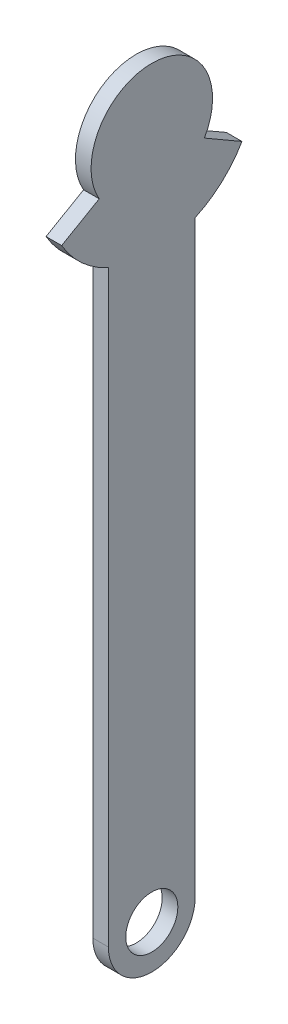
ISO-10303-21;
HEADER;
FILE_DESCRIPTION(('STEP AP214'),'2;1');
FILE_NAME('part.step','',(''),(''),'','','');
FILE_SCHEMA(('AUTOMOTIVE_DESIGN { 1 0 10303 214 1 1 1 1 }'));
ENDSEC;
DATA;
#1=APPLICATION_CONTEXT('core data for automotive mechanical design processes');
#2=APPLICATION_PROTOCOL_DEFINITION('international standard','automotive_design',2000,#1);
#3=PRODUCT_CONTEXT('',#1,'mechanical');
#4=PRODUCT('Part','Part','',(#3));
#5=PRODUCT_RELATED_PRODUCT_CATEGORY('part','',(#4));
#6=PRODUCT_DEFINITION_FORMATION('','',#4);
#7=PRODUCT_DEFINITION_CONTEXT('part definition',#1,'design');
#8=PRODUCT_DEFINITION('design','',#6,#7);
#9=PRODUCT_DEFINITION_SHAPE('','',#8);
#10=(LENGTH_UNIT() NAMED_UNIT(*) SI_UNIT(.MILLI.,.METRE.));
#11=(NAMED_UNIT(*) PLANE_ANGLE_UNIT() SI_UNIT($,.RADIAN.));
#12=(NAMED_UNIT(*) SI_UNIT($,.STERADIAN.) SOLID_ANGLE_UNIT());
#13=UNCERTAINTY_MEASURE_WITH_UNIT(LENGTH_MEASURE(1.E-05),#10,'distance_accuracy_value','');
#14=(GEOMETRIC_REPRESENTATION_CONTEXT(3) GLOBAL_UNCERTAINTY_ASSIGNED_CONTEXT((#13)) GLOBAL_UNIT_ASSIGNED_CONTEXT((#10,
#11,#12)) REPRESENTATION_CONTEXT('',''));
#15=CARTESIAN_POINT('',(0.,0.,0.));
#16=DIRECTION('',(0.,0.,1.));
#17=DIRECTION('',(1.,0.,0.));
#18=AXIS2_PLACEMENT_3D('',#15,#16,#17);
#19=CARTESIAN_POINT('',(9.,196.8,0.));
#20=DIRECTION('',(1.,0.,0.));
#21=DIRECTION('',(0.,0.,-1.));
#22=AXIS2_PLACEMENT_3D('',#19,#20,#21);
#23=PLANE('',#22);
#24=CARTESIAN_POINT('',(9.,196.8,0.));
#25=DIRECTION('',(1.,0.,0.));
#26=DIRECTION('',(0.,0.,-1.));
#27=AXIS2_PLACEMENT_3D('',#24,#25,#26);
#28=CIRCLE('',#27,60.);
#29=CARTESIAN_POINT('',(9.,142.256439426821,-25.));
#30=VERTEX_POINT('',#29);
#31=CARTESIAN_POINT('',(9.,166.8,-51.9615242270663));
#32=VERTEX_POINT('',#31);
#33=EDGE_CURVE('E170',#30,#32,#28,.T.);
#34=ORIENTED_EDGE('',*,*,#33,.T.);
#35=DIRECTION('',(0.,0.500000000000001,0.866025403784438));
#36=VECTOR('',#35,1.);
#37=CARTESIAN_POINT('',(9.,179.3,-30.3108891324553));
#38=LINE('',#37,#36);
#39=CARTESIAN_POINT('',(9.,179.3,-30.3108891324553));
#40=VERTEX_POINT('',#39);
#41=EDGE_CURVE('E111',#32,#40,#38,.T.);
#42=ORIENTED_EDGE('',*,*,#41,.T.);
#43=CARTESIAN_POINT('',(9.,196.8,0.));
#44=DIRECTION('',(1.,0.,0.));
#45=DIRECTION('',(0.,0.,-1.));
#46=AXIS2_PLACEMENT_3D('',#43,#44,#45);
#47=CIRCLE('',#46,35.);
#48=CARTESIAN_POINT('',(9.,179.3,30.3108891324555));
#49=VERTEX_POINT('',#48);
#50=EDGE_CURVE('E176',#40,#49,#47,.T.);
#51=ORIENTED_EDGE('',*,*,#50,.T.);
#52=DIRECTION('',(0.,-0.499999999999997,0.86602540378444));
#53=VECTOR('',#52,1.);
#54=CARTESIAN_POINT('',(9.,179.3,30.3108891324555));
#55=LINE('',#54,#53);
#56=CARTESIAN_POINT('',(9.,166.8,51.9615242270665));
#57=VERTEX_POINT('',#56);
#58=EDGE_CURVE('E183',#49,#57,#55,.T.);
#59=ORIENTED_EDGE('',*,*,#58,.T.);
#60=CARTESIAN_POINT('',(9.,196.8,0.));
#61=DIRECTION('',(1.,0.,0.));
#62=DIRECTION('',(0.,0.,-1.));
#63=AXIS2_PLACEMENT_3D('',#60,#61,#62);
#64=CIRCLE('',#63,60.);
#65=CARTESIAN_POINT('',(9.,142.256439426821,25.));
#66=VERTEX_POINT('',#65);
#67=EDGE_CURVE('E130',#57,#66,#64,.T.);
#68=ORIENTED_EDGE('',*,*,#67,.T.);
#69=DIRECTION('',(0.,-1.,0.));
#70=VECTOR('',#69,1.);
#71=CARTESIAN_POINT('',(9.,142.256439426821,25.));
#72=LINE('',#71,#70);
#73=CARTESIAN_POINT('',(9.,-196.8,25.));
#74=VERTEX_POINT('',#73);
#75=EDGE_CURVE('E124',#66,#74,#72,.T.);
#76=ORIENTED_EDGE('',*,*,#75,.T.);
#77=CARTESIAN_POINT('',(9.,-196.8,0.));
#78=DIRECTION('',(1.,0.,0.));
#79=DIRECTION('',(0.,0.,-1.));
#80=AXIS2_PLACEMENT_3D('',#77,#78,#79);
#81=CIRCLE('',#80,25.);
#82=CARTESIAN_POINT('',(9.,-196.8,-25.));
#83=VERTEX_POINT('',#82);
#84=EDGE_CURVE('E128',#74,#83,#81,.T.);
#85=ORIENTED_EDGE('',*,*,#84,.T.);
#86=DIRECTION('',(0.,1.,0.));
#87=VECTOR('',#86,1.);
#88=CARTESIAN_POINT('',(9.,142.256439426821,-25.));
#89=LINE('',#88,#87);
#90=EDGE_CURVE('E68',#83,#30,#89,.T.);
#91=ORIENTED_EDGE('',*,*,#90,.T.);
#92=EDGE_LOOP('',(#34,#42,#51,#59,#68,#76,#85,#91));
#93=FACE_BOUND('',#92,.T.);
#94=CARTESIAN_POINT('',(9.,-196.8,0.));
#95=DIRECTION('',(1.,0.,0.));
#96=DIRECTION('',(0.,0.,-1.));
#97=AXIS2_PLACEMENT_3D('',#94,#95,#96);
#98=CIRCLE('',#97,15.);
#99=CARTESIAN_POINT('',(9.,-196.8,-15.));
#100=VERTEX_POINT('',#99);
#101=EDGE_CURVE('E160',#100,#100,#98,.T.);
#102=ORIENTED_EDGE('',*,*,#101,.F.);
#103=EDGE_LOOP('',(#102));
#104=FACE_BOUND('',#103,.T.);
#105=ADVANCED_FACE('F50',(#93,#104),#23,.T.);
#106=CARTESIAN_POINT('',(0.,196.8,0.));
#107=DIRECTION('',(1.,0.,0.));
#108=DIRECTION('',(0.,0.,-1.));
#109=AXIS2_PLACEMENT_3D('',#106,#107,#108);
#110=PLANE('',#109);
#111=CARTESIAN_POINT('',(0.,196.8,0.));
#112=DIRECTION('',(1.,0.,0.));
#113=DIRECTION('',(0.,0.,-1.));
#114=AXIS2_PLACEMENT_3D('',#111,#112,#113);
#115=CIRCLE('',#114,60.);
#116=CARTESIAN_POINT('',(0.,142.256439426821,-25.));
#117=VERTEX_POINT('',#116);
#118=CARTESIAN_POINT('',(0.,166.8,-51.9615242270663));
#119=VERTEX_POINT('',#118);
#120=EDGE_CURVE('E164',#117,#119,#115,.T.);
#121=ORIENTED_EDGE('',*,*,#120,.F.);
#122=DIRECTION('',(0.,1.,0.));
#123=VECTOR('',#122,1.);
#124=CARTESIAN_POINT('',(0.,142.256439426821,-25.));
#125=LINE('',#124,#123);
#126=CARTESIAN_POINT('',(0.,-196.8,-25.));
#127=VERTEX_POINT('',#126);
#128=EDGE_CURVE('E103',#127,#117,#125,.T.);
#129=ORIENTED_EDGE('',*,*,#128,.F.);
#130=CARTESIAN_POINT('',(0.,-196.8,0.));
#131=DIRECTION('',(1.,0.,0.));
#132=DIRECTION('',(0.,0.,-1.));
#133=AXIS2_PLACEMENT_3D('',#130,#131,#132);
#134=CIRCLE('',#133,25.);
#135=CARTESIAN_POINT('',(0.,-196.8,25.));
#136=VERTEX_POINT('',#135);
#137=EDGE_CURVE('E97',#136,#127,#134,.T.);
#138=ORIENTED_EDGE('',*,*,#137,.F.);
#139=DIRECTION('',(0.,-1.,0.));
#140=VECTOR('',#139,1.);
#141=CARTESIAN_POINT('',(0.,142.256439426821,25.));
#142=LINE('',#141,#140);
#143=CARTESIAN_POINT('',(0.,142.256439426821,25.));
#144=VERTEX_POINT('',#143);
#145=EDGE_CURVE('E139',#144,#136,#142,.T.);
#146=ORIENTED_EDGE('',*,*,#145,.F.);
#147=CARTESIAN_POINT('',(0.,196.8,0.));
#148=DIRECTION('',(1.,0.,0.));
#149=DIRECTION('',(0.,0.,-1.));
#150=AXIS2_PLACEMENT_3D('',#147,#148,#149);
#151=CIRCLE('',#150,60.);
#152=CARTESIAN_POINT('',(0.,166.8,51.9615242270665));
#153=VERTEX_POINT('',#152);
#154=EDGE_CURVE('E209',#153,#144,#151,.T.);
#155=ORIENTED_EDGE('',*,*,#154,.F.);
#156=DIRECTION('',(0.,-0.499999999999997,0.86602540378444));
#157=VECTOR('',#156,1.);
#158=CARTESIAN_POINT('',(0.,179.3,30.3108891324555));
#159=LINE('',#158,#157);
#160=CARTESIAN_POINT('',(0.,179.3,30.3108891324555));
#161=VERTEX_POINT('',#160);
#162=EDGE_CURVE('E214',#161,#153,#159,.T.);
#163=ORIENTED_EDGE('',*,*,#162,.F.);
#164=CARTESIAN_POINT('',(0.,196.8,0.));
#165=DIRECTION('',(1.,0.,0.));
#166=DIRECTION('',(0.,0.,-1.));
#167=AXIS2_PLACEMENT_3D('',#164,#165,#166);
#168=CIRCLE('',#167,35.);
#169=CARTESIAN_POINT('',(0.,179.3,-30.3108891324553));
#170=VERTEX_POINT('',#169);
#171=EDGE_CURVE('E219',#170,#161,#168,.T.);
#172=ORIENTED_EDGE('',*,*,#171,.F.);
#173=DIRECTION('',(0.,0.500000000000001,0.866025403784438));
#174=VECTOR('',#173,1.);
#175=CARTESIAN_POINT('',(0.,179.3,-30.3108891324553));
#176=LINE('',#175,#174);
#177=EDGE_CURVE('E223',#119,#170,#176,.T.);
#178=ORIENTED_EDGE('',*,*,#177,.F.);
#179=EDGE_LOOP('',(#121,#129,#138,#146,#155,#163,#172,#178));
#180=FACE_BOUND('',#179,.T.);
#181=CARTESIAN_POINT('',(0.,-196.8,0.));
#182=DIRECTION('',(1.,0.,0.));
#183=DIRECTION('',(0.,0.,-1.));
#184=AXIS2_PLACEMENT_3D('',#181,#182,#183);
#185=CIRCLE('',#184,15.);
#186=CARTESIAN_POINT('',(0.,-196.8,-15.));
#187=VERTEX_POINT('',#186);
#188=EDGE_CURVE('E165',#187,#187,#185,.T.);
#189=ORIENTED_EDGE('',*,*,#188,.T.);
#190=EDGE_LOOP('',(#189));
#191=FACE_BOUND('',#190,.T.);
#192=ADVANCED_FACE('F267',(#180,#191),#110,.F.);
#193=CARTESIAN_POINT('',(9.,196.8,0.));
#194=DIRECTION('',(-1.,0.,0.));
#195=DIRECTION('',(0.,0.,1.));
#196=AXIS2_PLACEMENT_3D('',#193,#194,#195);
#197=CYLINDRICAL_SURFACE('',#196,60.);
#198=ORIENTED_EDGE('',*,*,#120,.T.);
#199=DIRECTION('',(-1.,0.,0.));
#200=VECTOR('',#199,1.);
#201=CARTESIAN_POINT('',(9.,166.8,-51.9615242270663));
#202=LINE('',#201,#200);
#203=EDGE_CURVE('E12',#32,#119,#202,.T.);
#204=ORIENTED_EDGE('',*,*,#203,.F.);
#205=ORIENTED_EDGE('',*,*,#33,.F.);
#206=DIRECTION('',(-1.,0.,0.));
#207=VECTOR('',#206,1.);
#208=CARTESIAN_POINT('',(9.,142.256439426821,-25.));
#209=LINE('',#208,#207);
#210=EDGE_CURVE('E149',#30,#117,#209,.T.);
#211=ORIENTED_EDGE('',*,*,#210,.T.);
#212=EDGE_LOOP('',(#198,#204,#205,#211));
#213=FACE_BOUND('',#212,.T.);
#214=ADVANCED_FACE('F52',(#213),#197,.T.);
#215=CARTESIAN_POINT('',(9.,179.3,-30.3108891324553));
#216=DIRECTION('',(0.,-0.866025403784438,0.500000000000001));
#217=DIRECTION('',(0.,-0.500000000000001,-0.866025403784438));
#218=AXIS2_PLACEMENT_3D('',#215,#216,#217);
#219=PLANE('',#218);
#220=ORIENTED_EDGE('',*,*,#177,.T.);
#221=DIRECTION('',(-1.,0.,0.));
#222=VECTOR('',#221,1.);
#223=CARTESIAN_POINT('',(9.,179.3,-30.3108891324553));
#224=LINE('',#223,#222);
#225=EDGE_CURVE('E60',#40,#170,#224,.T.);
#226=ORIENTED_EDGE('',*,*,#225,.F.);
#227=ORIENTED_EDGE('',*,*,#41,.F.);
#228=ORIENTED_EDGE('',*,*,#203,.T.);
#229=EDGE_LOOP('',(#220,#226,#227,#228));
#230=FACE_BOUND('',#229,.T.);
#231=ADVANCED_FACE('F337',(#230),#219,.F.);
#232=CARTESIAN_POINT('',(9.,196.8,0.));
#233=DIRECTION('',(-1.,0.,0.));
#234=DIRECTION('',(0.,0.,1.));
#235=AXIS2_PLACEMENT_3D('',#232,#233,#234);
#236=CYLINDRICAL_SURFACE('',#235,35.);
#237=ORIENTED_EDGE('',*,*,#171,.T.);
#238=DIRECTION('',(-1.,0.,0.));
#239=VECTOR('',#238,1.);
#240=CARTESIAN_POINT('',(9.,179.3,30.3108891324555));
#241=LINE('',#240,#239);
#242=EDGE_CURVE('E254',#49,#161,#241,.T.);
#243=ORIENTED_EDGE('',*,*,#242,.F.);
#244=ORIENTED_EDGE('',*,*,#50,.F.);
#245=ORIENTED_EDGE('',*,*,#225,.T.);
#246=EDGE_LOOP('',(#237,#243,#244,#245));
#247=FACE_BOUND('',#246,.T.);
#248=ADVANCED_FACE('F263',(#247),#236,.T.);
#249=CARTESIAN_POINT('',(9.,179.3,30.3108891324555));
#250=DIRECTION('',(0.,-0.86602540378444,-0.499999999999997));
#251=DIRECTION('',(0.,0.499999999999997,-0.86602540378444));
#252=AXIS2_PLACEMENT_3D('',#249,#250,#251);
#253=PLANE('',#252);
#254=ORIENTED_EDGE('',*,*,#162,.T.);
#255=DIRECTION('',(-1.,0.,0.));
#256=VECTOR('',#255,1.);
#257=CARTESIAN_POINT('',(9.,166.8,51.9615242270665));
#258=LINE('',#257,#256);
#259=EDGE_CURVE('E250',#57,#153,#258,.T.);
#260=ORIENTED_EDGE('',*,*,#259,.F.);
#261=ORIENTED_EDGE('',*,*,#58,.F.);
#262=ORIENTED_EDGE('',*,*,#242,.T.);
#263=EDGE_LOOP('',(#254,#260,#261,#262));
#264=FACE_BOUND('',#263,.T.);
#265=ADVANCED_FACE('F272',(#264),#253,.F.);
#266=CARTESIAN_POINT('',(9.,196.8,0.));
#267=DIRECTION('',(-1.,0.,0.));
#268=DIRECTION('',(0.,0.,1.));
#269=AXIS2_PLACEMENT_3D('',#266,#267,#268);
#270=CYLINDRICAL_SURFACE('',#269,60.);
#271=ORIENTED_EDGE('',*,*,#154,.T.);
#272=DIRECTION('',(-1.,0.,0.));
#273=VECTOR('',#272,1.);
#274=CARTESIAN_POINT('',(9.,142.256439426821,25.));
#275=LINE('',#274,#273);
#276=EDGE_CURVE('E141',#66,#144,#275,.T.);
#277=ORIENTED_EDGE('',*,*,#276,.F.);
#278=ORIENTED_EDGE('',*,*,#67,.F.);
#279=ORIENTED_EDGE('',*,*,#259,.T.);
#280=EDGE_LOOP('',(#271,#277,#278,#279));
#281=FACE_BOUND('',#280,.T.);
#282=ADVANCED_FACE('F275',(#281),#270,.T.);
#283=CARTESIAN_POINT('',(9.,142.256439426821,25.));
#284=DIRECTION('',(0.,0.,-1.));
#285=DIRECTION('',(0.,1.,0.));
#286=AXIS2_PLACEMENT_3D('',#283,#284,#285);
#287=PLANE('',#286);
#288=ORIENTED_EDGE('',*,*,#145,.T.);
#289=DIRECTION('',(-1.,0.,0.));
#290=VECTOR('',#289,1.);
#291=CARTESIAN_POINT('',(9.,-196.8,25.));
#292=LINE('',#291,#290);
#293=EDGE_CURVE('E136',#74,#136,#292,.T.);
#294=ORIENTED_EDGE('',*,*,#293,.F.);
#295=ORIENTED_EDGE('',*,*,#75,.F.);
#296=ORIENTED_EDGE('',*,*,#276,.T.);
#297=EDGE_LOOP('',(#288,#294,#295,#296));
#298=FACE_BOUND('',#297,.T.);
#299=ADVANCED_FACE('F137',(#298),#287,.F.);
#300=CARTESIAN_POINT('',(9.,-196.8,0.));
#301=DIRECTION('',(-1.,0.,0.));
#302=DIRECTION('',(0.,0.,1.));
#303=AXIS2_PLACEMENT_3D('',#300,#301,#302);
#304=CYLINDRICAL_SURFACE('',#303,25.);
#305=ORIENTED_EDGE('',*,*,#137,.T.);
#306=DIRECTION('',(-1.,0.,0.));
#307=VECTOR('',#306,1.);
#308=CARTESIAN_POINT('',(9.,-196.8,-25.));
#309=LINE('',#308,#307);
#310=EDGE_CURVE('E142',#83,#127,#309,.T.);
#311=ORIENTED_EDGE('',*,*,#310,.F.);
#312=ORIENTED_EDGE('',*,*,#84,.F.);
#313=ORIENTED_EDGE('',*,*,#293,.T.);
#314=EDGE_LOOP('',(#305,#311,#312,#313));
#315=FACE_BOUND('',#314,.T.);
#316=ADVANCED_FACE('F144',(#315),#304,.T.);
#317=CARTESIAN_POINT('',(9.,142.256439426821,-25.));
#318=DIRECTION('',(0.,0.,1.));
#319=DIRECTION('',(0.,-1.,0.));
#320=AXIS2_PLACEMENT_3D('',#317,#318,#319);
#321=PLANE('',#320);
#322=ORIENTED_EDGE('',*,*,#128,.T.);
#323=ORIENTED_EDGE('',*,*,#210,.F.);
#324=ORIENTED_EDGE('',*,*,#90,.F.);
#325=ORIENTED_EDGE('',*,*,#310,.T.);
#326=EDGE_LOOP('',(#322,#323,#324,#325));
#327=FACE_BOUND('',#326,.T.);
#328=ADVANCED_FACE('F293',(#327),#321,.F.);
#329=CARTESIAN_POINT('',(9.,-196.8,0.));
#330=DIRECTION('',(-1.,0.,0.));
#331=DIRECTION('',(0.,0.,1.));
#332=AXIS2_PLACEMENT_3D('',#329,#330,#331);
#333=CYLINDRICAL_SURFACE('',#332,15.);
#334=ORIENTED_EDGE('',*,*,#101,.T.);
#335=EDGE_LOOP('',(#334));
#336=FACE_BOUND('',#335,.T.);
#337=ORIENTED_EDGE('',*,*,#188,.F.);
#338=EDGE_LOOP('',(#337));
#339=FACE_BOUND('',#338,.T.);
#340=ADVANCED_FACE('F291',(#336,#339),#333,.F.);
#341=CLOSED_SHELL('',(#105,#192,#214,#231,#248,#265,#282,#299,#316,#328,#340));
#342=MANIFOLD_SOLID_BREP('B2',#341);
#343=ADVANCED_BREP_SHAPE_REPRESENTATION('',(#18,#342),#14);
#344=SHAPE_DEFINITION_REPRESENTATION(#9,#343);
ENDSEC;
END-ISO-10303-21;
